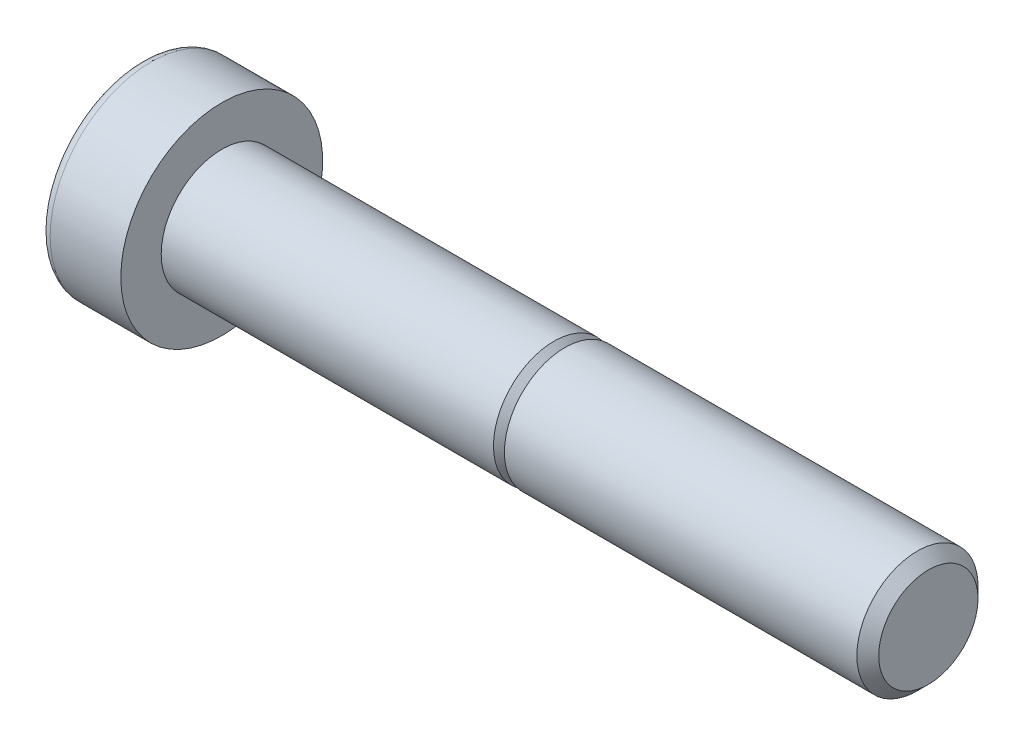
ISO-10303-21;
HEADER;
FILE_DESCRIPTION(('STEP AP214'),'2;1');
FILE_NAME('part.step','',(''),(''),'','','');
FILE_SCHEMA(('AUTOMOTIVE_DESIGN { 1 0 10303 214 1 1 1 1 }'));
ENDSEC;
DATA;
#1=APPLICATION_CONTEXT('core data for automotive mechanical design processes');
#2=APPLICATION_PROTOCOL_DEFINITION('international standard','automotive_design',2000,#1);
#3=PRODUCT_CONTEXT('',#1,'mechanical');
#4=PRODUCT('Part','Part','',(#3));
#5=PRODUCT_RELATED_PRODUCT_CATEGORY('part','',(#4));
#6=PRODUCT_DEFINITION_FORMATION('','',#4);
#7=PRODUCT_DEFINITION_CONTEXT('part definition',#1,'design');
#8=PRODUCT_DEFINITION('design','',#6,#7);
#9=PRODUCT_DEFINITION_SHAPE('','',#8);
#10=(LENGTH_UNIT() NAMED_UNIT(*) SI_UNIT(.MILLI.,.METRE.));
#11=(NAMED_UNIT(*) PLANE_ANGLE_UNIT() SI_UNIT($,.RADIAN.));
#12=(NAMED_UNIT(*) SI_UNIT($,.STERADIAN.) SOLID_ANGLE_UNIT());
#13=UNCERTAINTY_MEASURE_WITH_UNIT(LENGTH_MEASURE(1.E-05),#10,'distance_accuracy_value','');
#14=(GEOMETRIC_REPRESENTATION_CONTEXT(3) GLOBAL_UNCERTAINTY_ASSIGNED_CONTEXT((#13)) GLOBAL_UNIT_ASSIGNED_CONTEXT((#10,
#11,#12)) REPRESENTATION_CONTEXT('',''));
#15=CARTESIAN_POINT('',(0.,0.,0.));
#16=DIRECTION('',(0.,0.,1.));
#17=DIRECTION('',(1.,0.,0.));
#18=AXIS2_PLACEMENT_3D('',#15,#16,#17);
#19=CARTESIAN_POINT('',(0.,0.,0.));
#20=DIRECTION('',(-1.,0.,0.));
#21=DIRECTION('',(0.,0.,1.));
#22=AXIS2_PLACEMENT_3D('',#19,#20,#21);
#23=PLANE('',#22);
#24=CARTESIAN_POINT('',(0.,0.,0.));
#25=DIRECTION('',(-1.,0.,0.));
#26=DIRECTION('',(0.,0.,1.));
#27=AXIS2_PLACEMENT_3D('',#24,#25,#26);
#28=CIRCLE('',#27,5.);
#29=CARTESIAN_POINT('',(0.,0.,5.));
#30=VERTEX_POINT('',#29);
#31=EDGE_CURVE('E109',#30,#30,#28,.T.);
#32=ORIENTED_EDGE('',*,*,#31,.F.);
#33=EDGE_LOOP('',(#32));
#34=FACE_BOUND('',#33,.T.);
#35=CARTESIAN_POINT('',(0.,0.,0.));
#36=DIRECTION('',(-1.,0.,0.));
#37=DIRECTION('',(0.,0.,1.));
#38=AXIS2_PLACEMENT_3D('',#35,#36,#37);
#39=CIRCLE('',#38,3.);
#40=CARTESIAN_POINT('',(0.,0.,3.));
#41=VERTEX_POINT('',#40);
#42=EDGE_CURVE('E9',#41,#41,#39,.F.);
#43=ORIENTED_EDGE('',*,*,#42,.F.);
#44=EDGE_LOOP('',(#43));
#45=FACE_BOUND('',#44,.T.);
#46=ADVANCED_FACE('F15',(#34,#45),#23,.F.);
#47=CARTESIAN_POINT('',(-4.,4.5,0.));
#48=DIRECTION('',(1.,0.,0.));
#49=DIRECTION('',(0.,0.,-1.));
#50=AXIS2_PLACEMENT_3D('',#47,#48,#49);
#51=PLANE('',#50);
#52=CARTESIAN_POINT('',(-4.,0.,0.));
#53=DIRECTION('',(-1.,0.,0.));
#54=DIRECTION('',(0.,0.,1.));
#55=AXIS2_PLACEMENT_3D('',#52,#53,#54);
#56=CIRCLE('',#55,4.5);
#57=CARTESIAN_POINT('',(-4.,0.,4.5));
#58=VERTEX_POINT('',#57);
#59=EDGE_CURVE('E91',#58,#58,#56,.T.);
#60=ORIENTED_EDGE('',*,*,#59,.T.);
#61=EDGE_LOOP('',(#60));
#62=FACE_BOUND('',#61,.T.);
#63=DIRECTION('',(0.,0.5,0.866025403784439));
#64=VECTOR('',#63,1.);
#65=CARTESIAN_POINT('',(-4.,-1.04006350946109,3.19855715851499));
#66=LINE('',#65,#64);
#67=CARTESIAN_POINT('',(-4.,-2.88675134594813,0.));
#68=VERTEX_POINT('',#67);
#69=CARTESIAN_POINT('',(-4.,-1.44337567297406,2.5));
#70=VERTEX_POINT('',#69);
#71=EDGE_CURVE('E25',#68,#70,#66,.T.);
#72=ORIENTED_EDGE('',*,*,#71,.F.);
#73=DIRECTION('',(0.,-0.5,0.866025403784439));
#74=VECTOR('',#73,1.);
#75=CARTESIAN_POINT('',(-4.,-1.0400635094611,-3.19855715851499));
#76=LINE('',#75,#74);
#77=CARTESIAN_POINT('',(-4.,-1.44337567297406,-2.5));
#78=VERTEX_POINT('',#77);
#79=EDGE_CURVE('E40',#78,#68,#76,.T.);
#80=ORIENTED_EDGE('',*,*,#79,.F.);
#81=DIRECTION('',(0.,-1.,0.));
#82=VECTOR('',#81,1.);
#83=CARTESIAN_POINT('',(-4.,4.5,-2.5));
#84=LINE('',#83,#82);
#85=CARTESIAN_POINT('',(-4.,1.44337567297406,-2.5));
#86=VERTEX_POINT('',#85);
#87=EDGE_CURVE('E122',#86,#78,#84,.T.);
#88=ORIENTED_EDGE('',*,*,#87,.F.);
#89=DIRECTION('',(0.,-0.5,-0.866025403784439));
#90=VECTOR('',#89,1.);
#91=CARTESIAN_POINT('',(-4.,3.2900635094611,0.698557158514987));
#92=LINE('',#91,#90);
#93=CARTESIAN_POINT('',(-4.,2.88675134594813,0.));
#94=VERTEX_POINT('',#93);
#95=EDGE_CURVE('E119',#94,#86,#92,.T.);
#96=ORIENTED_EDGE('',*,*,#95,.F.);
#97=DIRECTION('',(0.,0.5,-0.866025403784439));
#98=VECTOR('',#97,1.);
#99=CARTESIAN_POINT('',(-4.,3.2900635094611,-0.698557158514987));
#100=LINE('',#99,#98);
#101=CARTESIAN_POINT('',(-4.,1.44337567297406,2.5));
#102=VERTEX_POINT('',#101);
#103=EDGE_CURVE('E116',#102,#94,#100,.T.);
#104=ORIENTED_EDGE('',*,*,#103,.F.);
#105=DIRECTION('',(0.,1.,0.));
#106=VECTOR('',#105,1.);
#107=CARTESIAN_POINT('',(-4.,4.5,2.5));
#108=LINE('',#107,#106);
#109=EDGE_CURVE('E113',#70,#102,#108,.T.);
#110=ORIENTED_EDGE('',*,*,#109,.F.);
#111=EDGE_LOOP('',(#72,#80,#88,#96,#104,#110));
#112=FACE_BOUND('',#111,.T.);
#113=ADVANCED_FACE('F17',(#62,#112),#51,.F.);
#114=CARTESIAN_POINT('',(-4.,0.,0.));
#115=DIRECTION('',(-1.,0.,0.));
#116=DIRECTION('',(0.,0.,1.));
#117=AXIS2_PLACEMENT_3D('',#114,#115,#116);
#118=CYLINDRICAL_SURFACE('',#117,5.);
#119=CARTESIAN_POINT('',(-3.5,0.,0.));
#120=DIRECTION('',(-1.,0.,0.));
#121=DIRECTION('',(0.,0.,1.));
#122=AXIS2_PLACEMENT_3D('',#119,#120,#121);
#123=CIRCLE('',#122,5.);
#124=CARTESIAN_POINT('',(-3.5,0.,5.));
#125=VERTEX_POINT('',#124);
#126=EDGE_CURVE('E99',#125,#125,#123,.T.);
#127=ORIENTED_EDGE('',*,*,#126,.F.);
#128=EDGE_LOOP('',(#127));
#129=FACE_BOUND('',#128,.T.);
#130=ORIENTED_EDGE('',*,*,#31,.T.);
#131=EDGE_LOOP('',(#130));
#132=FACE_BOUND('',#131,.T.);
#133=ADVANCED_FACE('F231',(#129,#132),#118,.T.);
#134=CARTESIAN_POINT('',(-3.5,0.,0.));
#135=DIRECTION('',(-1.,0.,0.));
#136=DIRECTION('',(0.,0.,1.));
#137=AXIS2_PLACEMENT_3D('',#134,#135,#136);
#138=TOROIDAL_SURFACE('',#137,4.5,0.5);
#139=ORIENTED_EDGE('',*,*,#59,.F.);
#140=EDGE_LOOP('',(#139));
#141=FACE_BOUND('',#140,.T.);
#142=ORIENTED_EDGE('',*,*,#126,.T.);
#143=EDGE_LOOP('',(#142));
#144=FACE_BOUND('',#143,.T.);
#145=ADVANCED_FACE('F238',(#141,#144),#138,.T.);
#146=CARTESIAN_POINT('',(-1.62,-1.44337567297406,2.5));
#147=DIRECTION('',(0.,0.866025403784438,-0.5));
#148=DIRECTION('',(0.,0.5,0.866025403784439));
#149=AXIS2_PLACEMENT_3D('',#146,#147,#148);
#150=PLANE('',#149);
#151=ORIENTED_EDGE('',*,*,#71,.T.);
#152=DIRECTION('',(-1.,0.,0.));
#153=VECTOR('',#152,1.);
#154=CARTESIAN_POINT('',(-1.62,-1.44337567297406,2.5));
#155=LINE('',#154,#153);
#156=CARTESIAN_POINT('',(-1.62,-1.44337567297406,2.5));
#157=VERTEX_POINT('',#156);
#158=EDGE_CURVE('E32',#157,#70,#155,.T.);
#159=ORIENTED_EDGE('',*,*,#158,.F.);
#160=DIRECTION('',(0.,-0.5,-0.866025403784438));
#161=VECTOR('',#160,1.);
#162=CARTESIAN_POINT('',(-1.62,-1.44337567297406,2.5));
#163=LINE('',#162,#161);
#164=CARTESIAN_POINT('',(-1.62,-2.88675134594813,0.));
#165=VERTEX_POINT('',#164);
#166=EDGE_CURVE('E76',#157,#165,#163,.T.);
#167=ORIENTED_EDGE('',*,*,#166,.T.);
#168=DIRECTION('',(-1.,0.,0.));
#169=VECTOR('',#168,1.);
#170=CARTESIAN_POINT('',(-1.62,-2.88675134594813,0.));
#171=LINE('',#170,#169);
#172=EDGE_CURVE('E84',#165,#68,#171,.T.);
#173=ORIENTED_EDGE('',*,*,#172,.T.);
#174=EDGE_LOOP('',(#151,#159,#167,#173));
#175=FACE_BOUND('',#174,.T.);
#176=ADVANCED_FACE('F83',(#175),#150,.T.);
#177=CARTESIAN_POINT('',(-1.62,-2.88675134594813,0.));
#178=DIRECTION('',(0.,0.866025403784439,0.5));
#179=DIRECTION('',(0.,-0.5,0.866025403784439));
#180=AXIS2_PLACEMENT_3D('',#177,#178,#179);
#181=PLANE('',#180);
#182=ORIENTED_EDGE('',*,*,#79,.T.);
#183=ORIENTED_EDGE('',*,*,#172,.F.);
#184=DIRECTION('',(0.,0.5,-0.866025403784439));
#185=VECTOR('',#184,1.);
#186=CARTESIAN_POINT('',(-1.62,-2.88675134594813,0.));
#187=LINE('',#186,#185);
#188=CARTESIAN_POINT('',(-1.62,-1.44337567297406,-2.5));
#189=VERTEX_POINT('',#188);
#190=EDGE_CURVE('E72',#165,#189,#187,.T.);
#191=ORIENTED_EDGE('',*,*,#190,.T.);
#192=DIRECTION('',(-1.,0.,0.));
#193=VECTOR('',#192,1.);
#194=CARTESIAN_POINT('',(-1.62,-1.44337567297406,-2.5));
#195=LINE('',#194,#193);
#196=EDGE_CURVE('E92',#189,#78,#195,.T.);
#197=ORIENTED_EDGE('',*,*,#196,.T.);
#198=EDGE_LOOP('',(#182,#183,#191,#197));
#199=FACE_BOUND('',#198,.T.);
#200=ADVANCED_FACE('F89',(#199),#181,.T.);
#201=CARTESIAN_POINT('',(-1.62,-1.44337567297406,-2.5));
#202=DIRECTION('',(0.,0.,1.));
#203=DIRECTION('',(0.,-1.,0.));
#204=AXIS2_PLACEMENT_3D('',#201,#202,#203);
#205=PLANE('',#204);
#206=ORIENTED_EDGE('',*,*,#87,.T.);
#207=ORIENTED_EDGE('',*,*,#196,.F.);
#208=DIRECTION('',(0.,1.,0.));
#209=VECTOR('',#208,1.);
#210=CARTESIAN_POINT('',(-1.62,-1.44337567297406,-2.5));
#211=LINE('',#210,#209);
#212=CARTESIAN_POINT('',(-1.62,1.44337567297406,-2.5));
#213=VERTEX_POINT('',#212);
#214=EDGE_CURVE('E78',#189,#213,#211,.T.);
#215=ORIENTED_EDGE('',*,*,#214,.T.);
#216=DIRECTION('',(-1.,0.,0.));
#217=VECTOR('',#216,1.);
#218=CARTESIAN_POINT('',(-1.62,1.44337567297406,-2.5));
#219=LINE('',#218,#217);
#220=EDGE_CURVE('E102',#213,#86,#219,.T.);
#221=ORIENTED_EDGE('',*,*,#220,.T.);
#222=EDGE_LOOP('',(#206,#207,#215,#221));
#223=FACE_BOUND('',#222,.T.);
#224=ADVANCED_FACE('F162',(#223),#205,.T.);
#225=CARTESIAN_POINT('',(-1.62,1.44337567297406,-2.5));
#226=DIRECTION('',(0.,-0.866025403784439,0.5));
#227=DIRECTION('',(0.,-0.5,-0.866025403784439));
#228=AXIS2_PLACEMENT_3D('',#225,#226,#227);
#229=PLANE('',#228);
#230=ORIENTED_EDGE('',*,*,#95,.T.);
#231=ORIENTED_EDGE('',*,*,#220,.F.);
#232=DIRECTION('',(0.,0.5,0.866025403784439));
#233=VECTOR('',#232,1.);
#234=CARTESIAN_POINT('',(-1.62,1.44337567297406,-2.5));
#235=LINE('',#234,#233);
#236=CARTESIAN_POINT('',(-1.62,2.88675134594813,0.));
#237=VERTEX_POINT('',#236);
#238=EDGE_CURVE('E165',#213,#237,#235,.T.);
#239=ORIENTED_EDGE('',*,*,#238,.T.);
#240=DIRECTION('',(-1.,0.,0.));
#241=VECTOR('',#240,1.);
#242=CARTESIAN_POINT('',(-1.62,2.88675134594813,0.));
#243=LINE('',#242,#241);
#244=EDGE_CURVE('E144',#237,#94,#243,.T.);
#245=ORIENTED_EDGE('',*,*,#244,.T.);
#246=EDGE_LOOP('',(#230,#231,#239,#245));
#247=FACE_BOUND('',#246,.T.);
#248=ADVANCED_FACE('F164',(#247),#229,.T.);
#249=CARTESIAN_POINT('',(-1.62,2.88675134594813,0.));
#250=DIRECTION('',(0.,-0.866025403784439,-0.5));
#251=DIRECTION('',(0.,0.5,-0.866025403784439));
#252=AXIS2_PLACEMENT_3D('',#249,#250,#251);
#253=PLANE('',#252);
#254=ORIENTED_EDGE('',*,*,#103,.T.);
#255=ORIENTED_EDGE('',*,*,#244,.F.);
#256=DIRECTION('',(0.,-0.5,0.866025403784439));
#257=VECTOR('',#256,1.);
#258=CARTESIAN_POINT('',(-1.62,2.88675134594813,0.));
#259=LINE('',#258,#257);
#260=CARTESIAN_POINT('',(-1.62,1.44337567297406,2.5));
#261=VERTEX_POINT('',#260);
#262=EDGE_CURVE('E142',#237,#261,#259,.T.);
#263=ORIENTED_EDGE('',*,*,#262,.T.);
#264=DIRECTION('',(-1.,0.,0.));
#265=VECTOR('',#264,1.);
#266=CARTESIAN_POINT('',(-1.62,1.44337567297406,2.5));
#267=LINE('',#266,#265);
#268=EDGE_CURVE('E136',#261,#102,#267,.T.);
#269=ORIENTED_EDGE('',*,*,#268,.T.);
#270=EDGE_LOOP('',(#254,#255,#263,#269));
#271=FACE_BOUND('',#270,.T.);
#272=ADVANCED_FACE('F138',(#271),#253,.T.);
#273=CARTESIAN_POINT('',(-1.62,1.44337567297407,2.5));
#274=DIRECTION('',(0.,0.,-1.));
#275=DIRECTION('',(0.,1.,0.));
#276=AXIS2_PLACEMENT_3D('',#273,#274,#275);
#277=PLANE('',#276);
#278=ORIENTED_EDGE('',*,*,#109,.T.);
#279=ORIENTED_EDGE('',*,*,#268,.F.);
#280=DIRECTION('',(0.,-1.,0.));
#281=VECTOR('',#280,1.);
#282=CARTESIAN_POINT('',(-1.62,1.44337567297407,2.5));
#283=LINE('',#282,#281);
#284=EDGE_CURVE('E152',#261,#157,#283,.T.);
#285=ORIENTED_EDGE('',*,*,#284,.T.);
#286=ORIENTED_EDGE('',*,*,#158,.T.);
#287=EDGE_LOOP('',(#278,#279,#285,#286));
#288=FACE_BOUND('',#287,.T.);
#289=ADVANCED_FACE('F135',(#288),#277,.T.);
#290=CARTESIAN_POINT('',(-1.62,-2.88675134594813,0.));
#291=DIRECTION('',(1.,0.,0.));
#292=DIRECTION('',(0.,0.,1.));
#293=AXIS2_PLACEMENT_3D('',#290,#291,#292);
#294=PLANE('',#293);
#295=CARTESIAN_POINT('',(-1.62,0.,0.));
#296=DIRECTION('',(1.,0.,0.));
#297=DIRECTION('',(0.,0.,-1.));
#298=AXIS2_PLACEMENT_3D('',#295,#296,#297);
#299=CIRCLE('',#298,1.5);
#300=CARTESIAN_POINT('',(-1.62,0.,-1.5));
#301=VERTEX_POINT('',#300);
#302=EDGE_CURVE('E19',#301,#301,#299,.T.);
#303=ORIENTED_EDGE('',*,*,#302,.T.);
#304=EDGE_LOOP('',(#303));
#305=FACE_BOUND('',#304,.T.);
#306=ORIENTED_EDGE('',*,*,#166,.F.);
#307=ORIENTED_EDGE('',*,*,#284,.F.);
#308=ORIENTED_EDGE('',*,*,#262,.F.);
#309=ORIENTED_EDGE('',*,*,#238,.F.);
#310=ORIENTED_EDGE('',*,*,#214,.F.);
#311=ORIENTED_EDGE('',*,*,#190,.F.);
#312=EDGE_LOOP('',(#306,#307,#308,#309,#310,#311));
#313=FACE_BOUND('',#312,.T.);
#314=ADVANCED_FACE('F74',(#305,#313),#294,.F.);
#315=CARTESIAN_POINT('',(0.,0.,0.));
#316=DIRECTION('',(-1.,0.,0.));
#317=DIRECTION('',(0.,0.,1.));
#318=AXIS2_PLACEMENT_3D('',#315,#316,#317);
#319=CYLINDRICAL_SURFACE('',#318,3.);
#320=CARTESIAN_POINT('',(16.45875,0.,0.));
#321=DIRECTION('',(-1.,0.,0.));
#322=DIRECTION('',(0.,0.,1.));
#323=AXIS2_PLACEMENT_3D('',#320,#321,#322);
#324=CIRCLE('',#323,3.);
#325=CARTESIAN_POINT('',(16.45875,0.,3.));
#326=VERTEX_POINT('',#325);
#327=EDGE_CURVE('E190',#326,#326,#324,.T.);
#328=ORIENTED_EDGE('',*,*,#327,.T.);
#329=EDGE_LOOP('',(#328));
#330=FACE_BOUND('',#329,.T.);
#331=ORIENTED_EDGE('',*,*,#42,.T.);
#332=EDGE_LOOP('',(#331));
#333=FACE_BOUND('',#332,.T.);
#334=ADVANCED_FACE('F257',(#330,#333),#319,.T.);
#335=CARTESIAN_POINT('',(35.,0.,0.));
#336=DIRECTION('',(-1.,0.,0.));
#337=DIRECTION('',(0.,0.,1.));
#338=AXIS2_PLACEMENT_3D('',#335,#336,#337);
#339=PLANE('',#338);
#340=CARTESIAN_POINT('',(35.,0.,0.));
#341=DIRECTION('',(-1.,0.,0.));
#342=DIRECTION('',(0.,0.,1.));
#343=AXIS2_PLACEMENT_3D('',#340,#341,#342);
#344=CIRCLE('',#343,2.45875);
#345=CARTESIAN_POINT('',(35.,0.,2.45875));
#346=VERTEX_POINT('',#345);
#347=EDGE_CURVE('E87',#346,#346,#344,.T.);
#348=ORIENTED_EDGE('',*,*,#347,.F.);
#349=EDGE_LOOP('',(#348));
#350=FACE_BOUND('',#349,.T.);
#351=ADVANCED_FACE('F258',(#350),#339,.F.);
#352=CARTESIAN_POINT('',(35.,0.,0.));
#353=DIRECTION('',(-1.,0.,0.));
#354=DIRECTION('',(0.,0.,1.));
#355=AXIS2_PLACEMENT_3D('',#352,#353,#354);
#356=CONICAL_SURFACE('',#355,2.45875,0.785398163397453);
#357=CARTESIAN_POINT('',(34.45875,0.,0.));
#358=DIRECTION('',(-1.,0.,0.));
#359=DIRECTION('',(0.,0.,1.));
#360=AXIS2_PLACEMENT_3D('',#357,#358,#359);
#361=CIRCLE('',#360,3.);
#362=CARTESIAN_POINT('',(34.45875,0.,3.));
#363=VERTEX_POINT('',#362);
#364=EDGE_CURVE('E178',#363,#363,#361,.T.);
#365=ORIENTED_EDGE('',*,*,#364,.F.);
#366=EDGE_LOOP('',(#365));
#367=FACE_BOUND('',#366,.T.);
#368=ORIENTED_EDGE('',*,*,#347,.T.);
#369=EDGE_LOOP('',(#368));
#370=FACE_BOUND('',#369,.T.);
#371=ADVANCED_FACE('F261',(#367,#370),#356,.T.);
#372=CARTESIAN_POINT('',(0.,0.,0.));
#373=DIRECTION('',(-1.,0.,0.));
#374=DIRECTION('',(0.,0.,1.));
#375=AXIS2_PLACEMENT_3D('',#372,#373,#374);
#376=CYLINDRICAL_SURFACE('',#375,3.);
#377=CARTESIAN_POINT('',(17.,0.,0.));
#378=DIRECTION('',(-1.,0.,0.));
#379=DIRECTION('',(0.,0.,1.));
#380=AXIS2_PLACEMENT_3D('',#377,#378,#379);
#381=CIRCLE('',#380,3.);
#382=CARTESIAN_POINT('',(17.,0.,3.));
#383=VERTEX_POINT('',#382);
#384=EDGE_CURVE('E182',#383,#383,#381,.T.);
#385=ORIENTED_EDGE('',*,*,#384,.F.);
#386=EDGE_LOOP('',(#385));
#387=FACE_BOUND('',#386,.T.);
#388=ORIENTED_EDGE('',*,*,#364,.T.);
#389=EDGE_LOOP('',(#388));
#390=FACE_BOUND('',#389,.T.);
#391=ADVANCED_FACE('F265',(#387,#390),#376,.T.);
#392=CARTESIAN_POINT('',(17.,3.,0.));
#393=DIRECTION('',(1.,0.,0.));
#394=DIRECTION('',(0.,0.,-1.));
#395=AXIS2_PLACEMENT_3D('',#392,#393,#394);
#396=PLANE('',#395);
#397=CARTESIAN_POINT('',(17.,0.,0.));
#398=DIRECTION('',(-1.,0.,0.));
#399=DIRECTION('',(0.,0.,1.));
#400=AXIS2_PLACEMENT_3D('',#397,#398,#399);
#401=CIRCLE('',#400,2.45875);
#402=CARTESIAN_POINT('',(17.,0.,2.45875));
#403=VERTEX_POINT('',#402);
#404=EDGE_CURVE('E186',#403,#403,#401,.T.);
#405=ORIENTED_EDGE('',*,*,#404,.F.);
#406=EDGE_LOOP('',(#405));
#407=FACE_BOUND('',#406,.T.);
#408=ORIENTED_EDGE('',*,*,#384,.T.);
#409=EDGE_LOOP('',(#408));
#410=FACE_BOUND('',#409,.T.);
#411=ADVANCED_FACE('F222',(#407,#410),#396,.F.);
#412=CARTESIAN_POINT('',(17.,0.,0.));
#413=DIRECTION('',(-1.,0.,0.));
#414=DIRECTION('',(0.,0.,1.));
#415=AXIS2_PLACEMENT_3D('',#412,#413,#414);
#416=CONICAL_SURFACE('',#415,2.45875,0.785398163397449);
#417=ORIENTED_EDGE('',*,*,#327,.F.);
#418=EDGE_LOOP('',(#417));
#419=FACE_BOUND('',#418,.T.);
#420=ORIENTED_EDGE('',*,*,#404,.T.);
#421=EDGE_LOOP('',(#420));
#422=FACE_BOUND('',#421,.T.);
#423=ADVANCED_FACE('F213',(#419,#422),#416,.T.);
#424=CARTESIAN_POINT('',(0.,0.,0.));
#425=DIRECTION('',(-1.,0.,0.));
#426=DIRECTION('',(0.,1.,0.));
#427=AXIS2_PLACEMENT_3D('',#424,#425,#426);
#428=CYLINDRICAL_SURFACE('',#427,1.5);
#429=CARTESIAN_POINT('',(0.,0.,0.));
#430=DIRECTION('',(-1.,0.,0.));
#431=DIRECTION('',(0.,1.,0.));
#432=AXIS2_PLACEMENT_3D('',#429,#430,#431);
#433=CIRCLE('',#432,1.5);
#434=CARTESIAN_POINT('',(0.,1.5,0.));
#435=VERTEX_POINT('',#434);
#436=EDGE_CURVE('E194',#435,#435,#433,.T.);
#437=ORIENTED_EDGE('',*,*,#436,.F.);
#438=EDGE_LOOP('',(#437));
#439=FACE_BOUND('',#438,.T.);
#440=ORIENTED_EDGE('',*,*,#302,.F.);
#441=EDGE_LOOP('',(#440));
#442=FACE_BOUND('',#441,.T.);
#443=ADVANCED_FACE('F210',(#439,#442),#428,.F.);
#444=CARTESIAN_POINT('',(0.,0.,0.));
#445=DIRECTION('',(1.,0.,0.));
#446=DIRECTION('',(0.,0.,-1.));
#447=AXIS2_PLACEMENT_3D('',#444,#445,#446);
#448=PLANE('',#447);
#449=ORIENTED_EDGE('',*,*,#436,.T.);
#450=EDGE_LOOP('',(#449));
#451=FACE_BOUND('',#450,.T.);
#452=ADVANCED_FACE('F212',(#451),#448,.F.);
#453=CLOSED_SHELL('',(#46,#113,#133,#145,#176,#200,#224,#248,#272,#289,#314,#334,#351,#371,#391,
#411,#423,#443,#452));
#454=MANIFOLD_SOLID_BREP('B1',#453);
#455=ADVANCED_BREP_SHAPE_REPRESENTATION('',(#18,#454),#14);
#456=SHAPE_DEFINITION_REPRESENTATION(#9,#455);
ENDSEC;
END-ISO-10303-21;
